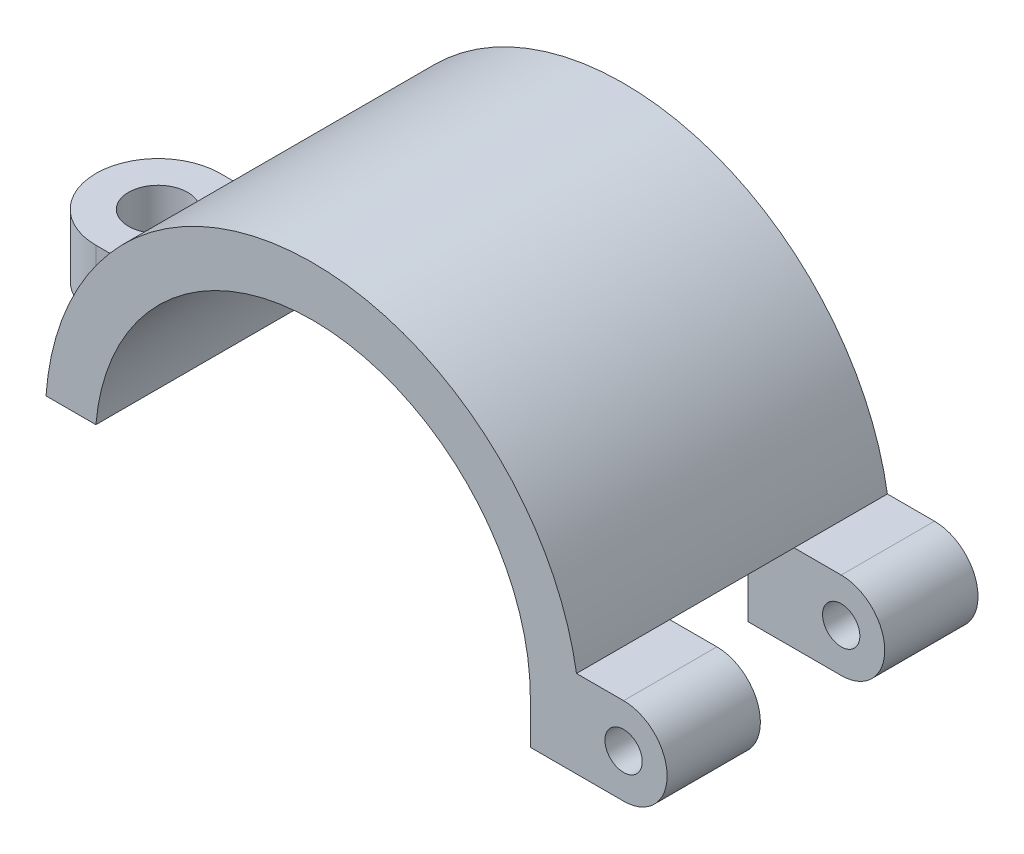
ISO-10303-21;
HEADER;
FILE_DESCRIPTION(('STEP AP214'),'2;1');
FILE_NAME('part.step','',(''),(''),'','','');
FILE_SCHEMA(('AUTOMOTIVE_DESIGN { 1 0 10303 214 1 1 1 1 }'));
ENDSEC;
DATA;
#1=APPLICATION_CONTEXT('core data for automotive mechanical design processes');
#2=APPLICATION_PROTOCOL_DEFINITION('international standard','automotive_design',2000,#1);
#3=PRODUCT_CONTEXT('',#1,'mechanical');
#4=PRODUCT('Part','Part','',(#3));
#5=PRODUCT_RELATED_PRODUCT_CATEGORY('part','',(#4));
#6=PRODUCT_DEFINITION_FORMATION('','',#4);
#7=PRODUCT_DEFINITION_CONTEXT('part definition',#1,'design');
#8=PRODUCT_DEFINITION('design','',#6,#7);
#9=PRODUCT_DEFINITION_SHAPE('','',#8);
#10=(LENGTH_UNIT() NAMED_UNIT(*) SI_UNIT(.MILLI.,.METRE.));
#11=(NAMED_UNIT(*) PLANE_ANGLE_UNIT() SI_UNIT($,.RADIAN.));
#12=(NAMED_UNIT(*) SI_UNIT($,.STERADIAN.) SOLID_ANGLE_UNIT());
#13=UNCERTAINTY_MEASURE_WITH_UNIT(LENGTH_MEASURE(1.E-05),#10,'distance_accuracy_value','');
#14=(GEOMETRIC_REPRESENTATION_CONTEXT(3) GLOBAL_UNCERTAINTY_ASSIGNED_CONTEXT((#13)) GLOBAL_UNIT_ASSIGNED_CONTEXT((#10,
#11,#12)) REPRESENTATION_CONTEXT('',''));
#15=CARTESIAN_POINT('',(0.,0.,0.));
#16=DIRECTION('',(0.,0.,1.));
#17=DIRECTION('',(1.,0.,0.));
#18=AXIS2_PLACEMENT_3D('',#15,#16,#17);
#19=CARTESIAN_POINT('',(0.,0.,25.));
#20=DIRECTION('',(0.,0.,-1.));
#21=DIRECTION('',(-1.,0.,0.));
#22=AXIS2_PLACEMENT_3D('',#19,#20,#21);
#23=CYLINDRICAL_SURFACE('',#22,17.5);
#24=CARTESIAN_POINT('',(0.,0.,17.5));
#25=DIRECTION('',(0.,0.,-1.));
#26=DIRECTION('',(-1.,0.,0.));
#27=AXIS2_PLACEMENT_3D('',#24,#25,#26);
#28=CIRCLE('',#27,17.5);
#29=CARTESIAN_POINT('',(17.5,0.,17.5));
#30=VERTEX_POINT('',#29);
#31=CARTESIAN_POINT('',(17.1464281994822,3.5,17.5));
#32=VERTEX_POINT('',#31);
#33=EDGE_CURVE('E327',#30,#32,#28,.F.);
#34=ORIENTED_EDGE('',*,*,#33,.F.);
#35=DIRECTION('',(0.,0.,-1.));
#36=VECTOR('',#35,1.);
#37=CARTESIAN_POINT('',(17.5,0.,25.));
#38=LINE('',#37,#36);
#39=CARTESIAN_POINT('',(17.5,0.,25.));
#40=VERTEX_POINT('',#39);
#41=EDGE_CURVE('E54',#40,#30,#38,.T.);
#42=ORIENTED_EDGE('',*,*,#41,.F.);
#43=CARTESIAN_POINT('',(0.,0.,25.));
#44=DIRECTION('',(0.,0.,-1.));
#45=DIRECTION('',(-1.,0.,0.));
#46=AXIS2_PLACEMENT_3D('',#43,#44,#45);
#47=CIRCLE('',#46,17.5);
#48=CARTESIAN_POINT('',(-17.4355957741627,1.5,25.));
#49=VERTEX_POINT('',#48);
#50=EDGE_CURVE('E297',#49,#40,#47,.T.);
#51=ORIENTED_EDGE('',*,*,#50,.F.);
#52=DIRECTION('',(0.,0.,-1.));
#53=VECTOR('',#52,1.);
#54=CARTESIAN_POINT('',(-17.4355957741627,1.5,25.));
#55=LINE('',#54,#53);
#56=CARTESIAN_POINT('',(-17.4355957741627,1.5,0.));
#57=VERTEX_POINT('',#56);
#58=EDGE_CURVE('E305',#49,#57,#55,.T.);
#59=ORIENTED_EDGE('',*,*,#58,.T.);
#60=CARTESIAN_POINT('',(0.,0.,0.));
#61=DIRECTION('',(0.,0.,-1.));
#62=DIRECTION('',(-1.,0.,0.));
#63=AXIS2_PLACEMENT_3D('',#60,#61,#62);
#64=CIRCLE('',#63,17.5);
#65=CARTESIAN_POINT('',(17.5,0.,0.));
#66=VERTEX_POINT('',#65);
#67=EDGE_CURVE('E296',#57,#66,#64,.T.);
#68=ORIENTED_EDGE('',*,*,#67,.T.);
#69=DIRECTION('',(0.,0.,1.));
#70=VECTOR('',#69,1.);
#71=CARTESIAN_POINT('',(17.5,0.,25.));
#72=LINE('',#71,#70);
#73=CARTESIAN_POINT('',(17.5,0.,7.5));
#74=VERTEX_POINT('',#73);
#75=EDGE_CURVE('E197',#66,#74,#72,.T.);
#76=ORIENTED_EDGE('',*,*,#75,.T.);
#77=CARTESIAN_POINT('',(0.,0.,7.5));
#78=DIRECTION('',(0.,0.,1.));
#79=DIRECTION('',(1.,0.,0.));
#80=AXIS2_PLACEMENT_3D('',#77,#78,#79);
#81=CIRCLE('',#80,17.5);
#82=CARTESIAN_POINT('',(17.1464281994822,3.5,7.5));
#83=VERTEX_POINT('',#82);
#84=EDGE_CURVE('E178',#83,#74,#81,.F.);
#85=ORIENTED_EDGE('',*,*,#84,.F.);
#86=DIRECTION('',(0.,0.,-1.));
#87=VECTOR('',#86,1.);
#88=CARTESIAN_POINT('',(17.1464281994822,3.5,25.));
#89=LINE('',#88,#87);
#90=EDGE_CURVE('E174',#32,#83,#89,.T.);
#91=ORIENTED_EDGE('',*,*,#90,.F.);
#92=EDGE_LOOP('',(#34,#42,#51,#59,#68,#76,#85,#91));
#93=FACE_BOUND('',#92,.T.);
#94=ADVANCED_FACE('F47',(#93),#23,.F.);
#95=CARTESIAN_POINT('',(0.,0.,25.));
#96=DIRECTION('',(0.,0.,-1.));
#97=DIRECTION('',(-1.,0.,0.));
#98=AXIS2_PLACEMENT_3D('',#95,#96,#97);
#99=CYLINDRICAL_SURFACE('',#98,21.5);
#100=DIRECTION('',(0.,0.,-1.));
#101=VECTOR('',#100,1.);
#102=CARTESIAN_POINT('',(21.2132034355964,3.5,25.));
#103=LINE('',#102,#101);
#104=CARTESIAN_POINT('',(21.2132034355964,3.5,7.5));
#105=VERTEX_POINT('',#104);
#106=CARTESIAN_POINT('',(21.2132034355964,3.5,17.5));
#107=VERTEX_POINT('',#106);
#108=EDGE_CURVE('E171',#105,#107,#103,.F.);
#109=ORIENTED_EDGE('',*,*,#108,.F.);
#110=DIRECTION('',(0.,0.,-1.));
#111=VECTOR('',#110,1.);
#112=CARTESIAN_POINT('',(21.2132034355964,3.5,25.));
#113=LINE('',#112,#111);
#114=CARTESIAN_POINT('',(21.2132034355964,3.5,0.));
#115=VERTEX_POINT('',#114);
#116=EDGE_CURVE('E186',#105,#115,#113,.T.);
#117=ORIENTED_EDGE('',*,*,#116,.T.);
#118=CARTESIAN_POINT('',(0.,0.,0.));
#119=DIRECTION('',(0.,0.,1.));
#120=DIRECTION('',(-1.,0.,0.));
#121=AXIS2_PLACEMENT_3D('',#118,#119,#120);
#122=CIRCLE('',#121,21.5);
#123=CARTESIAN_POINT('',(-21.4476105895272,1.5,0.));
#124=VERTEX_POINT('',#123);
#125=EDGE_CURVE('E307',#115,#124,#122,.T.);
#126=ORIENTED_EDGE('',*,*,#125,.T.);
#127=DIRECTION('',(0.,0.,-1.));
#128=VECTOR('',#127,1.);
#129=CARTESIAN_POINT('',(-21.4476105895272,1.5,25.));
#130=LINE('',#129,#128);
#131=CARTESIAN_POINT('',(-21.4476105895272,1.5,7.5));
#132=VERTEX_POINT('',#131);
#133=EDGE_CURVE('E312',#132,#124,#130,.T.);
#134=ORIENTED_EDGE('',*,*,#133,.F.);
#135=CARTESIAN_POINT('',(0.,0.,7.5));
#136=DIRECTION('',(0.,0.,-1.));
#137=DIRECTION('',(-1.,0.,0.));
#138=AXIS2_PLACEMENT_3D('',#135,#136,#137);
#139=CIRCLE('',#138,21.5);
#140=CARTESIAN_POINT('',(-20.4939015319192,6.49999999999997,7.5));
#141=VERTEX_POINT('',#140);
#142=EDGE_CURVE('E293',#132,#141,#139,.T.);
#143=ORIENTED_EDGE('',*,*,#142,.T.);
#144=DIRECTION('',(0.,0.,-1.));
#145=VECTOR('',#144,1.);
#146=CARTESIAN_POINT('',(-20.4939015319192,6.49999999999997,25.));
#147=LINE('',#146,#145);
#148=CARTESIAN_POINT('',(-20.4939015319192,6.49999999999997,17.5));
#149=VERTEX_POINT('',#148);
#150=EDGE_CURVE('E13',#141,#149,#147,.F.);
#151=ORIENTED_EDGE('',*,*,#150,.T.);
#152=CARTESIAN_POINT('',(0.,0.,17.5));
#153=DIRECTION('',(0.,0.,1.));
#154=DIRECTION('',(1.,0.,0.));
#155=AXIS2_PLACEMENT_3D('',#152,#153,#154);
#156=CIRCLE('',#155,21.5);
#157=CARTESIAN_POINT('',(-21.4476105895272,1.49999999999997,17.5));
#158=VERTEX_POINT('',#157);
#159=EDGE_CURVE('E288',#149,#158,#156,.T.);
#160=ORIENTED_EDGE('',*,*,#159,.T.);
#161=CARTESIAN_POINT('',(-21.4476105895272,1.5,25.));
#162=VERTEX_POINT('',#161);
#163=EDGE_CURVE('E313',#162,#158,#130,.T.);
#164=ORIENTED_EDGE('',*,*,#163,.F.);
#165=CARTESIAN_POINT('',(0.,0.,25.));
#166=DIRECTION('',(0.,0.,1.));
#167=DIRECTION('',(-1.,0.,0.));
#168=AXIS2_PLACEMENT_3D('',#165,#166,#167);
#169=CIRCLE('',#168,21.5);
#170=CARTESIAN_POINT('',(21.2132034355964,3.5,25.));
#171=VERTEX_POINT('',#170);
#172=EDGE_CURVE('E300',#171,#162,#169,.T.);
#173=ORIENTED_EDGE('',*,*,#172,.F.);
#174=DIRECTION('',(0.,0.,-1.));
#175=VECTOR('',#174,1.);
#176=CARTESIAN_POINT('',(21.2132034355964,3.5,25.));
#177=LINE('',#176,#175);
#178=EDGE_CURVE('E189',#171,#107,#177,.T.);
#179=ORIENTED_EDGE('',*,*,#178,.T.);
#180=EDGE_LOOP('',(#109,#117,#126,#134,#143,#151,#160,#164,#173,#179));
#181=FACE_BOUND('',#180,.T.);
#182=ADVANCED_FACE('F185',(#181),#99,.T.);
#183=CARTESIAN_POINT('',(-17.4355957741627,1.5,25.));
#184=DIRECTION('',(0.,1.,0.));
#185=DIRECTION('',(-1.,0.,0.));
#186=AXIS2_PLACEMENT_3D('',#183,#184,#185);
#187=PLANE('',#186);
#188=ORIENTED_EDGE('',*,*,#163,.T.);
#189=DIRECTION('',(-1.,0.,0.));
#190=VECTOR('',#189,1.);
#191=CARTESIAN_POINT('',(-17.4355957741627,1.49999999999998,17.5));
#192=LINE('',#191,#190);
#193=CARTESIAN_POINT('',(-24.9355957741627,1.49999999999997,17.5));
#194=VERTEX_POINT('',#193);
#195=EDGE_CURVE('E270',#158,#194,#192,.T.);
#196=ORIENTED_EDGE('',*,*,#195,.T.);
#197=CARTESIAN_POINT('',(-24.9355957741627,1.49999999999997,12.5));
#198=DIRECTION('',(0.,-1.,0.));
#199=DIRECTION('',(-1.,0.,0.));
#200=AXIS2_PLACEMENT_3D('',#197,#198,#199);
#201=CIRCLE('',#200,5.);
#202=CARTESIAN_POINT('',(-24.9355957741627,1.49999999999997,7.5));
#203=VERTEX_POINT('',#202);
#204=EDGE_CURVE('E283',#194,#203,#201,.T.);
#205=ORIENTED_EDGE('',*,*,#204,.T.);
#206=DIRECTION('',(1.,0.,0.));
#207=VECTOR('',#206,1.);
#208=CARTESIAN_POINT('',(-17.4355957741627,1.49999999999998,7.5));
#209=LINE('',#208,#207);
#210=EDGE_CURVE('E69',#203,#132,#209,.T.);
#211=ORIENTED_EDGE('',*,*,#210,.T.);
#212=ORIENTED_EDGE('',*,*,#133,.T.);
#213=DIRECTION('',(1.,0.,0.));
#214=VECTOR('',#213,1.);
#215=CARTESIAN_POINT('',(-17.4355957741627,1.5,0.));
#216=LINE('',#215,#214);
#217=EDGE_CURVE('E301',#124,#57,#216,.T.);
#218=ORIENTED_EDGE('',*,*,#217,.T.);
#219=ORIENTED_EDGE('',*,*,#58,.F.);
#220=DIRECTION('',(1.,0.,0.));
#221=VECTOR('',#220,1.);
#222=CARTESIAN_POINT('',(-17.4355957741627,1.5,25.));
#223=LINE('',#222,#221);
#224=EDGE_CURVE('E303',#162,#49,#223,.T.);
#225=ORIENTED_EDGE('',*,*,#224,.F.);
#226=EDGE_LOOP('',(#188,#196,#205,#211,#212,#218,#219,#225));
#227=FACE_BOUND('',#226,.T.);
#228=CARTESIAN_POINT('',(-24.9355957741627,1.49999999999997,12.5));
#229=DIRECTION('',(0.,-1.,0.));
#230=DIRECTION('',(1.,0.,0.));
#231=AXIS2_PLACEMENT_3D('',#228,#229,#230);
#232=CIRCLE('',#231,2.375);
#233=CARTESIAN_POINT('',(-22.5605957741627,1.49999999999997,12.5));
#234=VERTEX_POINT('',#233);
#235=EDGE_CURVE('E266',#234,#234,#232,.T.);
#236=ORIENTED_EDGE('',*,*,#235,.F.);
#237=EDGE_LOOP('',(#236));
#238=FACE_BOUND('',#237,.T.);
#239=ADVANCED_FACE('F341',(#227,#238),#187,.F.);
#240=CARTESIAN_POINT('',(0.,0.,25.));
#241=DIRECTION('',(0.,0.,-1.));
#242=DIRECTION('',(-1.,0.,0.));
#243=AXIS2_PLACEMENT_3D('',#240,#241,#242);
#244=PLANE('',#243);
#245=ORIENTED_EDGE('',*,*,#50,.T.);
#246=DIRECTION('',(0.,-1.,0.));
#247=VECTOR('',#246,1.);
#248=CARTESIAN_POINT('',(17.5,-3.5,25.));
#249=LINE('',#248,#247);
#250=CARTESIAN_POINT('',(17.5,-3.5,25.));
#251=VERTEX_POINT('',#250);
#252=EDGE_CURVE('E237',#40,#251,#249,.T.);
#253=ORIENTED_EDGE('',*,*,#252,.T.);
#254=DIRECTION('',(1.,0.,0.));
#255=VECTOR('',#254,1.);
#256=CARTESIAN_POINT('',(17.5,-3.5,25.));
#257=LINE('',#256,#255);
#258=CARTESIAN_POINT('',(25.,-3.5,25.));
#259=VERTEX_POINT('',#258);
#260=EDGE_CURVE('E253',#251,#259,#257,.T.);
#261=ORIENTED_EDGE('',*,*,#260,.T.);
#262=CARTESIAN_POINT('',(25.,0.,25.));
#263=DIRECTION('',(0.,0.,1.));
#264=DIRECTION('',(-1.,0.,0.));
#265=AXIS2_PLACEMENT_3D('',#262,#263,#264);
#266=CIRCLE('',#265,3.5);
#267=CARTESIAN_POINT('',(25.,3.5,25.));
#268=VERTEX_POINT('',#267);
#269=EDGE_CURVE('E256',#259,#268,#266,.T.);
#270=ORIENTED_EDGE('',*,*,#269,.T.);
#271=DIRECTION('',(-1.,0.,0.));
#272=VECTOR('',#271,1.);
#273=CARTESIAN_POINT('',(17.5,3.5,25.));
#274=LINE('',#273,#272);
#275=EDGE_CURVE('E61',#268,#171,#274,.T.);
#276=ORIENTED_EDGE('',*,*,#275,.T.);
#277=ORIENTED_EDGE('',*,*,#172,.T.);
#278=ORIENTED_EDGE('',*,*,#224,.T.);
#279=EDGE_LOOP('',(#245,#253,#261,#270,#276,#277,#278));
#280=FACE_BOUND('',#279,.T.);
#281=CARTESIAN_POINT('',(25.,0.,25.));
#282=DIRECTION('',(0.,0.,1.));
#283=DIRECTION('',(1.,0.,0.));
#284=AXIS2_PLACEMENT_3D('',#281,#282,#283);
#285=CIRCLE('',#284,1.5);
#286=CARTESIAN_POINT('',(26.5,0.,25.));
#287=VERTEX_POINT('',#286);
#288=EDGE_CURVE('E233',#287,#287,#285,.T.);
#289=ORIENTED_EDGE('',*,*,#288,.F.);
#290=EDGE_LOOP('',(#289));
#291=FACE_BOUND('',#290,.T.);
#292=ADVANCED_FACE('F334',(#280,#291),#244,.F.);
#293=CARTESIAN_POINT('',(0.,0.,0.));
#294=DIRECTION('',(0.,0.,-1.));
#295=DIRECTION('',(-1.,0.,0.));
#296=AXIS2_PLACEMENT_3D('',#293,#294,#295);
#297=PLANE('',#296);
#298=DIRECTION('',(0.,1.,0.));
#299=VECTOR('',#298,1.);
#300=CARTESIAN_POINT('',(17.5,-3.5,0.));
#301=LINE('',#300,#299);
#302=CARTESIAN_POINT('',(17.5,-3.5,0.));
#303=VERTEX_POINT('',#302);
#304=EDGE_CURVE('E217',#303,#66,#301,.T.);
#305=ORIENTED_EDGE('',*,*,#304,.T.);
#306=ORIENTED_EDGE('',*,*,#67,.F.);
#307=ORIENTED_EDGE('',*,*,#217,.F.);
#308=ORIENTED_EDGE('',*,*,#125,.F.);
#309=DIRECTION('',(1.,0.,0.));
#310=VECTOR('',#309,1.);
#311=CARTESIAN_POINT('',(17.5,3.5,0.));
#312=LINE('',#311,#310);
#313=CARTESIAN_POINT('',(25.,3.5,0.));
#314=VERTEX_POINT('',#313);
#315=EDGE_CURVE('E196',#115,#314,#312,.T.);
#316=ORIENTED_EDGE('',*,*,#315,.T.);
#317=CARTESIAN_POINT('',(25.,0.,0.));
#318=DIRECTION('',(0.,0.,-1.));
#319=DIRECTION('',(1.,0.,0.));
#320=AXIS2_PLACEMENT_3D('',#317,#318,#319);
#321=CIRCLE('',#320,3.5);
#322=CARTESIAN_POINT('',(25.,-3.5,0.));
#323=VERTEX_POINT('',#322);
#324=EDGE_CURVE('E222',#314,#323,#321,.T.);
#325=ORIENTED_EDGE('',*,*,#324,.T.);
#326=DIRECTION('',(-1.,0.,0.));
#327=VECTOR('',#326,1.);
#328=CARTESIAN_POINT('',(17.5,-3.5,0.));
#329=LINE('',#328,#327);
#330=EDGE_CURVE('E210',#323,#303,#329,.T.);
#331=ORIENTED_EDGE('',*,*,#330,.T.);
#332=EDGE_LOOP('',(#305,#306,#307,#308,#316,#325,#331));
#333=FACE_BOUND('',#332,.T.);
#334=CARTESIAN_POINT('',(25.,0.,0.));
#335=DIRECTION('',(0.,0.,-1.));
#336=DIRECTION('',(-1.,0.,0.));
#337=AXIS2_PLACEMENT_3D('',#334,#335,#336);
#338=CIRCLE('',#337,1.5);
#339=CARTESIAN_POINT('',(23.5,0.,0.));
#340=VERTEX_POINT('',#339);
#341=EDGE_CURVE('E357',#340,#340,#338,.T.);
#342=ORIENTED_EDGE('',*,*,#341,.F.);
#343=EDGE_LOOP('',(#342));
#344=FACE_BOUND('',#343,.T.);
#345=ADVANCED_FACE('F345',(#333,#344),#297,.T.);
#346=CARTESIAN_POINT('',(-24.9355957741627,6.49999999999997,12.5));
#347=DIRECTION('',(0.,1.,0.));
#348=DIRECTION('',(-1.,0.,0.));
#349=AXIS2_PLACEMENT_3D('',#346,#347,#348);
#350=PLANE('',#349);
#351=CARTESIAN_POINT('',(-24.9355957741627,6.49999999999997,12.5));
#352=DIRECTION('',(0.,-1.,0.));
#353=DIRECTION('',(1.,0.,0.));
#354=AXIS2_PLACEMENT_3D('',#351,#352,#353);
#355=CIRCLE('',#354,2.375);
#356=CARTESIAN_POINT('',(-22.5605957741627,6.49999999999997,12.5));
#357=VERTEX_POINT('',#356);
#358=EDGE_CURVE('E267',#357,#357,#355,.T.);
#359=ORIENTED_EDGE('',*,*,#358,.T.);
#360=EDGE_LOOP('',(#359));
#361=FACE_BOUND('',#360,.T.);
#362=ORIENTED_EDGE('',*,*,#150,.F.);
#363=DIRECTION('',(1.,0.,0.));
#364=VECTOR('',#363,1.);
#365=CARTESIAN_POINT('',(-17.4355957741627,6.49999999999998,7.5));
#366=LINE('',#365,#364);
#367=CARTESIAN_POINT('',(-24.9355957741627,6.49999999999997,7.5));
#368=VERTEX_POINT('',#367);
#369=EDGE_CURVE('E278',#368,#141,#366,.T.);
#370=ORIENTED_EDGE('',*,*,#369,.F.);
#371=CARTESIAN_POINT('',(-24.9355957741627,6.49999999999997,12.5));
#372=DIRECTION('',(0.,-1.,0.));
#373=DIRECTION('',(-1.,0.,0.));
#374=AXIS2_PLACEMENT_3D('',#371,#372,#373);
#375=CIRCLE('',#374,5.);
#376=CARTESIAN_POINT('',(-24.9355957741627,6.49999999999997,17.5));
#377=VERTEX_POINT('',#376);
#378=EDGE_CURVE('E275',#377,#368,#375,.T.);
#379=ORIENTED_EDGE('',*,*,#378,.F.);
#380=DIRECTION('',(-1.,0.,0.));
#381=VECTOR('',#380,1.);
#382=CARTESIAN_POINT('',(-17.4355957741627,6.49999999999998,17.5));
#383=LINE('',#382,#381);
#384=EDGE_CURVE('E273',#149,#377,#383,.T.);
#385=ORIENTED_EDGE('',*,*,#384,.F.);
#386=EDGE_LOOP('',(#362,#370,#379,#385));
#387=FACE_BOUND('',#386,.T.);
#388=ADVANCED_FACE('F364',(#361,#387),#350,.T.);
#389=CARTESIAN_POINT('',(-17.4355957741627,6.49999999999998,7.5));
#390=DIRECTION('',(0.,0.,-1.));
#391=DIRECTION('',(-1.,0.,0.));
#392=AXIS2_PLACEMENT_3D('',#389,#390,#391);
#393=PLANE('',#392);
#394=ORIENTED_EDGE('',*,*,#142,.F.);
#395=ORIENTED_EDGE('',*,*,#210,.F.);
#396=DIRECTION('',(0.,-1.,0.));
#397=VECTOR('',#396,1.);
#398=CARTESIAN_POINT('',(-24.9355957741627,6.49999999999997,7.5));
#399=LINE('',#398,#397);
#400=EDGE_CURVE('E286',#368,#203,#399,.T.);
#401=ORIENTED_EDGE('',*,*,#400,.F.);
#402=ORIENTED_EDGE('',*,*,#369,.T.);
#403=EDGE_LOOP('',(#394,#395,#401,#402));
#404=FACE_BOUND('',#403,.T.);
#405=ADVANCED_FACE('F370',(#404),#393,.T.);
#406=CARTESIAN_POINT('',(-17.4355957741627,6.49999999999998,17.5));
#407=DIRECTION('',(0.,0.,1.));
#408=DIRECTION('',(1.,0.,0.));
#409=AXIS2_PLACEMENT_3D('',#406,#407,#408);
#410=PLANE('',#409);
#411=ORIENTED_EDGE('',*,*,#159,.F.);
#412=ORIENTED_EDGE('',*,*,#384,.T.);
#413=DIRECTION('',(0.,-1.,0.));
#414=VECTOR('',#413,1.);
#415=CARTESIAN_POINT('',(-24.9355957741627,6.49999999999997,17.5));
#416=LINE('',#415,#414);
#417=EDGE_CURVE('E281',#377,#194,#416,.T.);
#418=ORIENTED_EDGE('',*,*,#417,.T.);
#419=ORIENTED_EDGE('',*,*,#195,.F.);
#420=EDGE_LOOP('',(#411,#412,#418,#419));
#421=FACE_BOUND('',#420,.T.);
#422=ADVANCED_FACE('F537',(#421),#410,.T.);
#423=CARTESIAN_POINT('',(-24.9355957741627,6.49999999999997,12.5));
#424=DIRECTION('',(0.,-1.,0.));
#425=DIRECTION('',(1.,0.,0.));
#426=AXIS2_PLACEMENT_3D('',#423,#424,#425);
#427=CYLINDRICAL_SURFACE('',#426,5.);
#428=ORIENTED_EDGE('',*,*,#204,.F.);
#429=ORIENTED_EDGE('',*,*,#417,.F.);
#430=ORIENTED_EDGE('',*,*,#378,.T.);
#431=ORIENTED_EDGE('',*,*,#400,.T.);
#432=EDGE_LOOP('',(#428,#429,#430,#431));
#433=FACE_BOUND('',#432,.T.);
#434=ADVANCED_FACE('F532',(#433),#427,.T.);
#435=CARTESIAN_POINT('',(-24.9355957741627,6.49999999999997,12.5));
#436=DIRECTION('',(0.,-1.,0.));
#437=DIRECTION('',(1.,0.,0.));
#438=AXIS2_PLACEMENT_3D('',#435,#436,#437);
#439=CYLINDRICAL_SURFACE('',#438,2.375);
#440=ORIENTED_EDGE('',*,*,#358,.F.);
#441=EDGE_LOOP('',(#440));
#442=FACE_BOUND('',#441,.T.);
#443=ORIENTED_EDGE('',*,*,#235,.T.);
#444=EDGE_LOOP('',(#443));
#445=FACE_BOUND('',#444,.T.);
#446=ADVANCED_FACE('F398',(#442,#445),#439,.F.);
#447=CARTESIAN_POINT('',(17.5,-3.5,17.5));
#448=DIRECTION('',(-1.,0.,0.));
#449=DIRECTION('',(0.,0.,1.));
#450=AXIS2_PLACEMENT_3D('',#447,#448,#449);
#451=PLANE('',#450);
#452=ORIENTED_EDGE('',*,*,#41,.T.);
#453=DIRECTION('',(0.,-1.,0.));
#454=VECTOR('',#453,1.);
#455=CARTESIAN_POINT('',(17.5,-3.5,17.5));
#456=LINE('',#455,#454);
#457=CARTESIAN_POINT('',(17.5,-3.5,17.5));
#458=VERTEX_POINT('',#457);
#459=EDGE_CURVE('E240',#30,#458,#456,.T.);
#460=ORIENTED_EDGE('',*,*,#459,.T.);
#461=DIRECTION('',(0.,0.,1.));
#462=VECTOR('',#461,1.);
#463=CARTESIAN_POINT('',(17.5,-3.5,17.5));
#464=LINE('',#463,#462);
#465=EDGE_CURVE('E251',#458,#251,#464,.T.);
#466=ORIENTED_EDGE('',*,*,#465,.T.);
#467=ORIENTED_EDGE('',*,*,#252,.F.);
#468=EDGE_LOOP('',(#452,#460,#466,#467));
#469=FACE_BOUND('',#468,.T.);
#470=ADVANCED_FACE('F319',(#469),#451,.T.);
#471=CARTESIAN_POINT('',(17.5,3.5,17.5));
#472=DIRECTION('',(0.,1.,0.));
#473=DIRECTION('',(-1.,0.,0.));
#474=AXIS2_PLACEMENT_3D('',#471,#472,#473);
#475=PLANE('',#474);
#476=ORIENTED_EDGE('',*,*,#178,.F.);
#477=ORIENTED_EDGE('',*,*,#275,.F.);
#478=DIRECTION('',(0.,0.,1.));
#479=VECTOR('',#478,1.);
#480=CARTESIAN_POINT('',(25.,3.5,17.5));
#481=LINE('',#480,#479);
#482=CARTESIAN_POINT('',(25.,3.5,17.5));
#483=VERTEX_POINT('',#482);
#484=EDGE_CURVE('E259',#483,#268,#481,.T.);
#485=ORIENTED_EDGE('',*,*,#484,.F.);
#486=DIRECTION('',(-1.,0.,0.));
#487=VECTOR('',#486,1.);
#488=CARTESIAN_POINT('',(17.5,3.5,17.5));
#489=LINE('',#488,#487);
#490=EDGE_CURVE('E248',#483,#107,#489,.T.);
#491=ORIENTED_EDGE('',*,*,#490,.T.);
#492=EDGE_LOOP('',(#476,#477,#485,#491));
#493=FACE_BOUND('',#492,.T.);
#494=ADVANCED_FACE('F407',(#493),#475,.T.);
#495=CARTESIAN_POINT('',(25.,0.,17.5));
#496=DIRECTION('',(0.,0.,1.));
#497=DIRECTION('',(1.,0.,0.));
#498=AXIS2_PLACEMENT_3D('',#495,#496,#497);
#499=CYLINDRICAL_SURFACE('',#498,3.5);
#500=ORIENTED_EDGE('',*,*,#269,.F.);
#501=DIRECTION('',(0.,0.,1.));
#502=VECTOR('',#501,1.);
#503=CARTESIAN_POINT('',(25.,-3.5,17.5));
#504=LINE('',#503,#502);
#505=CARTESIAN_POINT('',(25.,-3.5,17.5));
#506=VERTEX_POINT('',#505);
#507=EDGE_CURVE('E261',#506,#259,#504,.T.);
#508=ORIENTED_EDGE('',*,*,#507,.F.);
#509=CARTESIAN_POINT('',(25.,0.,17.5));
#510=DIRECTION('',(0.,0.,1.));
#511=DIRECTION('',(-1.,0.,0.));
#512=AXIS2_PLACEMENT_3D('',#509,#510,#511);
#513=CIRCLE('',#512,3.5);
#514=EDGE_CURVE('E245',#506,#483,#513,.T.);
#515=ORIENTED_EDGE('',*,*,#514,.T.);
#516=ORIENTED_EDGE('',*,*,#484,.T.);
#517=EDGE_LOOP('',(#500,#508,#515,#516));
#518=FACE_BOUND('',#517,.T.);
#519=ADVANCED_FACE('F402',(#518),#499,.T.);
#520=CARTESIAN_POINT('',(17.5,-3.5,17.5));
#521=DIRECTION('',(0.,-1.,0.));
#522=DIRECTION('',(0.,0.,-1.));
#523=AXIS2_PLACEMENT_3D('',#520,#521,#522);
#524=PLANE('',#523);
#525=ORIENTED_EDGE('',*,*,#260,.F.);
#526=ORIENTED_EDGE('',*,*,#465,.F.);
#527=DIRECTION('',(1.,0.,0.));
#528=VECTOR('',#527,1.);
#529=CARTESIAN_POINT('',(17.5,-3.5,17.5));
#530=LINE('',#529,#528);
#531=EDGE_CURVE('E242',#458,#506,#530,.T.);
#532=ORIENTED_EDGE('',*,*,#531,.T.);
#533=ORIENTED_EDGE('',*,*,#507,.T.);
#534=EDGE_LOOP('',(#525,#526,#532,#533));
#535=FACE_BOUND('',#534,.T.);
#536=ADVANCED_FACE('F332',(#535),#524,.T.);
#537=CARTESIAN_POINT('',(25.,0.,17.5));
#538=DIRECTION('',(0.,0.,-1.));
#539=DIRECTION('',(-1.,0.,0.));
#540=AXIS2_PLACEMENT_3D('',#537,#538,#539);
#541=PLANE('',#540);
#542=ORIENTED_EDGE('',*,*,#459,.F.);
#543=ORIENTED_EDGE('',*,*,#33,.T.);
#544=DIRECTION('',(1.,0.,0.));
#545=VECTOR('',#544,1.);
#546=CARTESIAN_POINT('',(13.8851128911028,3.5,17.5));
#547=LINE('',#546,#545);
#548=EDGE_CURVE('E179',#32,#107,#547,.T.);
#549=ORIENTED_EDGE('',*,*,#548,.T.);
#550=ORIENTED_EDGE('',*,*,#490,.F.);
#551=ORIENTED_EDGE('',*,*,#514,.F.);
#552=ORIENTED_EDGE('',*,*,#531,.F.);
#553=EDGE_LOOP('',(#542,#543,#549,#550,#551,#552));
#554=FACE_BOUND('',#553,.T.);
#555=CARTESIAN_POINT('',(25.,0.,17.5));
#556=DIRECTION('',(0.,0.,1.));
#557=DIRECTION('',(1.,0.,0.));
#558=AXIS2_PLACEMENT_3D('',#555,#556,#557);
#559=CIRCLE('',#558,1.5);
#560=CARTESIAN_POINT('',(26.5,0.,17.5));
#561=VERTEX_POINT('',#560);
#562=EDGE_CURVE('E234',#561,#561,#559,.T.);
#563=ORIENTED_EDGE('',*,*,#562,.T.);
#564=EDGE_LOOP('',(#563));
#565=FACE_BOUND('',#564,.T.);
#566=ADVANCED_FACE('F325',(#554,#565),#541,.T.);
#567=CARTESIAN_POINT('',(25.,0.,17.5));
#568=DIRECTION('',(0.,0.,1.));
#569=DIRECTION('',(1.,0.,0.));
#570=AXIS2_PLACEMENT_3D('',#567,#568,#569);
#571=CYLINDRICAL_SURFACE('',#570,1.5);
#572=ORIENTED_EDGE('',*,*,#562,.F.);
#573=EDGE_LOOP('',(#572));
#574=FACE_BOUND('',#573,.T.);
#575=ORIENTED_EDGE('',*,*,#288,.T.);
#576=EDGE_LOOP('',(#575));
#577=FACE_BOUND('',#576,.T.);
#578=ADVANCED_FACE('F482',(#574,#577),#571,.F.);
#579=CARTESIAN_POINT('',(17.5,-3.5,7.5));
#580=DIRECTION('',(-1.,0.,0.));
#581=DIRECTION('',(0.,0.,1.));
#582=AXIS2_PLACEMENT_3D('',#579,#580,#581);
#583=PLANE('',#582);
#584=ORIENTED_EDGE('',*,*,#75,.F.);
#585=ORIENTED_EDGE('',*,*,#304,.F.);
#586=DIRECTION('',(0.,0.,-1.));
#587=VECTOR('',#586,1.);
#588=CARTESIAN_POINT('',(17.5,-3.5,7.5));
#589=LINE('',#588,#587);
#590=CARTESIAN_POINT('',(17.5,-3.5,7.5));
#591=VERTEX_POINT('',#590);
#592=EDGE_CURVE('E198',#591,#303,#589,.T.);
#593=ORIENTED_EDGE('',*,*,#592,.F.);
#594=DIRECTION('',(0.,1.,0.));
#595=VECTOR('',#594,1.);
#596=CARTESIAN_POINT('',(17.5,-3.5,7.5));
#597=LINE('',#596,#595);
#598=EDGE_CURVE('E205',#591,#74,#597,.T.);
#599=ORIENTED_EDGE('',*,*,#598,.T.);
#600=EDGE_LOOP('',(#584,#585,#593,#599));
#601=FACE_BOUND('',#600,.T.);
#602=ADVANCED_FACE('F350',(#601),#583,.T.);
#603=CARTESIAN_POINT('',(17.5,3.5,7.5));
#604=DIRECTION('',(0.,1.,0.));
#605=DIRECTION('',(-1.,0.,0.));
#606=AXIS2_PLACEMENT_3D('',#603,#604,#605);
#607=PLANE('',#606);
#608=ORIENTED_EDGE('',*,*,#116,.F.);
#609=DIRECTION('',(1.,0.,0.));
#610=VECTOR('',#609,1.);
#611=CARTESIAN_POINT('',(17.5,3.5,7.5));
#612=LINE('',#611,#610);
#613=CARTESIAN_POINT('',(25.,3.5,7.5));
#614=VERTEX_POINT('',#613);
#615=EDGE_CURVE('E194',#105,#614,#612,.T.);
#616=ORIENTED_EDGE('',*,*,#615,.T.);
#617=DIRECTION('',(0.,0.,-1.));
#618=VECTOR('',#617,1.);
#619=CARTESIAN_POINT('',(25.,3.5,7.5));
#620=LINE('',#619,#618);
#621=EDGE_CURVE('E216',#614,#314,#620,.T.);
#622=ORIENTED_EDGE('',*,*,#621,.T.);
#623=ORIENTED_EDGE('',*,*,#315,.F.);
#624=EDGE_LOOP('',(#608,#616,#622,#623));
#625=FACE_BOUND('',#624,.T.);
#626=ADVANCED_FACE('F192',(#625),#607,.T.);
#627=CARTESIAN_POINT('',(17.5,-3.5,7.5));
#628=DIRECTION('',(0.,-1.,0.));
#629=DIRECTION('',(1.,0.,0.));
#630=AXIS2_PLACEMENT_3D('',#627,#628,#629);
#631=PLANE('',#630);
#632=ORIENTED_EDGE('',*,*,#330,.F.);
#633=DIRECTION('',(0.,0.,-1.));
#634=VECTOR('',#633,1.);
#635=CARTESIAN_POINT('',(25.,-3.5,7.5));
#636=LINE('',#635,#634);
#637=CARTESIAN_POINT('',(25.,-3.5,7.5));
#638=VERTEX_POINT('',#637);
#639=EDGE_CURVE('E228',#638,#323,#636,.T.);
#640=ORIENTED_EDGE('',*,*,#639,.F.);
#641=DIRECTION('',(-1.,0.,0.));
#642=VECTOR('',#641,1.);
#643=CARTESIAN_POINT('',(17.5,-3.5,7.5));
#644=LINE('',#643,#642);
#645=EDGE_CURVE('E207',#638,#591,#644,.T.);
#646=ORIENTED_EDGE('',*,*,#645,.T.);
#647=ORIENTED_EDGE('',*,*,#592,.T.);
#648=EDGE_LOOP('',(#632,#640,#646,#647));
#649=FACE_BOUND('',#648,.T.);
#650=ADVANCED_FACE('F432',(#649),#631,.T.);
#651=CARTESIAN_POINT('',(25.,0.,7.5));
#652=DIRECTION('',(0.,0.,-1.));
#653=DIRECTION('',(-1.,0.,0.));
#654=AXIS2_PLACEMENT_3D('',#651,#652,#653);
#655=CYLINDRICAL_SURFACE('',#654,3.5);
#656=ORIENTED_EDGE('',*,*,#324,.F.);
#657=ORIENTED_EDGE('',*,*,#621,.F.);
#658=CARTESIAN_POINT('',(25.,0.,7.5));
#659=DIRECTION('',(0.,0.,-1.));
#660=DIRECTION('',(1.,0.,0.));
#661=AXIS2_PLACEMENT_3D('',#658,#659,#660);
#662=CIRCLE('',#661,3.5);
#663=EDGE_CURVE('E204',#614,#638,#662,.T.);
#664=ORIENTED_EDGE('',*,*,#663,.T.);
#665=ORIENTED_EDGE('',*,*,#639,.T.);
#666=EDGE_LOOP('',(#656,#657,#664,#665));
#667=FACE_BOUND('',#666,.T.);
#668=ADVANCED_FACE('F437',(#667),#655,.T.);
#669=CARTESIAN_POINT('',(25.,0.,7.5));
#670=DIRECTION('',(0.,0.,1.));
#671=DIRECTION('',(1.,0.,0.));
#672=AXIS2_PLACEMENT_3D('',#669,#670,#671);
#673=PLANE('',#672);
#674=CARTESIAN_POINT('',(25.,0.,7.5));
#675=DIRECTION('',(0.,0.,-1.));
#676=DIRECTION('',(-1.,0.,0.));
#677=AXIS2_PLACEMENT_3D('',#674,#675,#676);
#678=CIRCLE('',#677,1.5);
#679=CARTESIAN_POINT('',(23.5,0.,7.5));
#680=VERTEX_POINT('',#679);
#681=EDGE_CURVE('E220',#680,#680,#678,.T.);
#682=ORIENTED_EDGE('',*,*,#681,.T.);
#683=EDGE_LOOP('',(#682));
#684=FACE_BOUND('',#683,.T.);
#685=ORIENTED_EDGE('',*,*,#663,.F.);
#686=ORIENTED_EDGE('',*,*,#615,.F.);
#687=DIRECTION('',(-1.,0.,0.));
#688=VECTOR('',#687,1.);
#689=CARTESIAN_POINT('',(13.8851128911028,3.5,7.5));
#690=LINE('',#689,#688);
#691=EDGE_CURVE('E167',#105,#83,#690,.T.);
#692=ORIENTED_EDGE('',*,*,#691,.T.);
#693=ORIENTED_EDGE('',*,*,#84,.T.);
#694=ORIENTED_EDGE('',*,*,#598,.F.);
#695=ORIENTED_EDGE('',*,*,#645,.F.);
#696=EDGE_LOOP('',(#685,#686,#692,#693,#694,#695));
#697=FACE_BOUND('',#696,.T.);
#698=ADVANCED_FACE('F201',(#684,#697),#673,.T.);
#699=CARTESIAN_POINT('',(25.,0.,7.5));
#700=DIRECTION('',(0.,0.,-1.));
#701=DIRECTION('',(-1.,0.,0.));
#702=AXIS2_PLACEMENT_3D('',#699,#700,#701);
#703=CYLINDRICAL_SURFACE('',#702,1.5);
#704=ORIENTED_EDGE('',*,*,#681,.F.);
#705=EDGE_LOOP('',(#704));
#706=FACE_BOUND('',#705,.T.);
#707=ORIENTED_EDGE('',*,*,#341,.T.);
#708=EDGE_LOOP('',(#707));
#709=FACE_BOUND('',#708,.T.);
#710=ADVANCED_FACE('F362',(#706,#709),#703,.F.);
#711=CARTESIAN_POINT('',(13.8851128911028,3.5,-7.51443524285438));
#712=DIRECTION('',(0.,-1.,0.));
#713=DIRECTION('',(0.,0.,-1.));
#714=AXIS2_PLACEMENT_3D('',#711,#712,#713);
#715=PLANE('',#714);
#716=ORIENTED_EDGE('',*,*,#90,.T.);
#717=ORIENTED_EDGE('',*,*,#691,.F.);
#718=ORIENTED_EDGE('',*,*,#108,.T.);
#719=ORIENTED_EDGE('',*,*,#548,.F.);
#720=EDGE_LOOP('',(#716,#717,#718,#719));
#721=FACE_BOUND('',#720,.T.);
#722=ADVANCED_FACE('F169',(#721),#715,.T.);
#723=CLOSED_SHELL('',(#94,#182,#239,#292,#345,#388,#405,#422,#434,#446,#470,#494,#519,#536,#566,
#578,#602,#626,#650,#668,#698,#710,#722));
#724=MANIFOLD_SOLID_BREP('B2',#723);
#725=ADVANCED_BREP_SHAPE_REPRESENTATION('',(#18,#724),#14);
#726=SHAPE_DEFINITION_REPRESENTATION(#9,#725);
ENDSEC;
END-ISO-10303-21;
